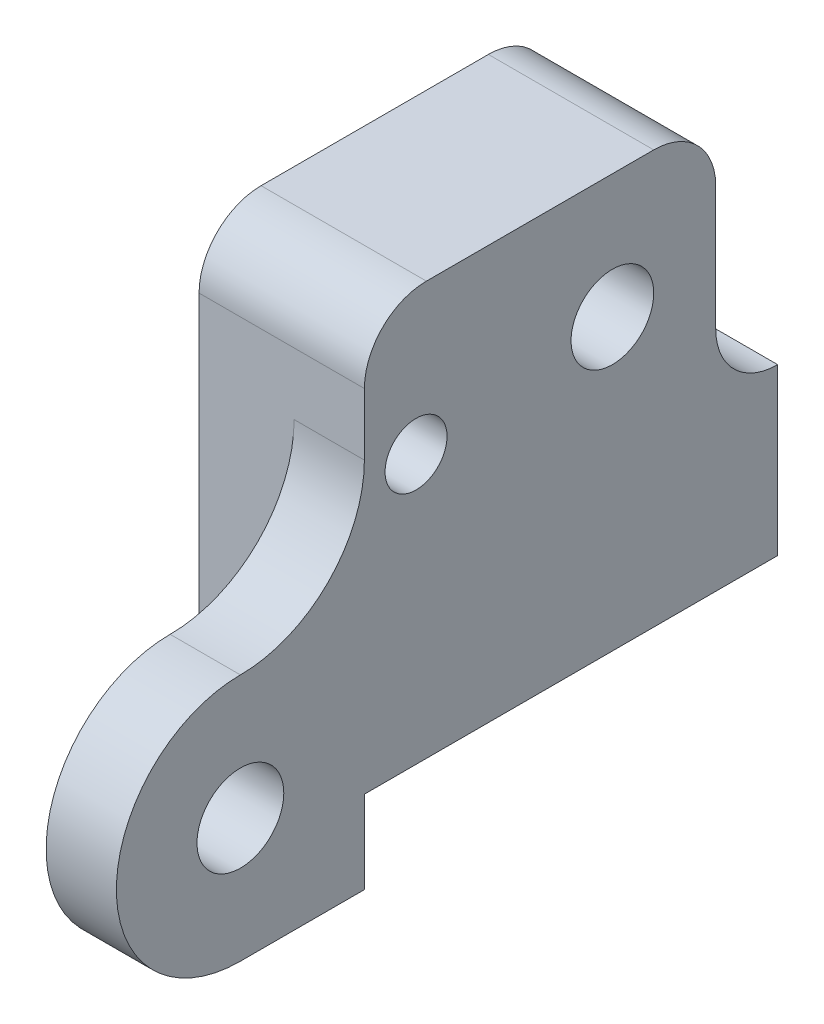
ISO-10303-21;
HEADER;
FILE_DESCRIPTION(('STEP AP214'),'2;1');
FILE_NAME('part.step','',(''),(''),'','','');
FILE_SCHEMA(('AUTOMOTIVE_DESIGN { 1 0 10303 214 1 1 1 1 }'));
ENDSEC;
DATA;
#1=APPLICATION_CONTEXT('core data for automotive mechanical design processes');
#2=APPLICATION_PROTOCOL_DEFINITION('international standard','automotive_design',2000,#1);
#3=PRODUCT_CONTEXT('',#1,'mechanical');
#4=PRODUCT('Part','Part','',(#3));
#5=PRODUCT_RELATED_PRODUCT_CATEGORY('part','',(#4));
#6=PRODUCT_DEFINITION_FORMATION('','',#4);
#7=PRODUCT_DEFINITION_CONTEXT('part definition',#1,'design');
#8=PRODUCT_DEFINITION('design','',#6,#7);
#9=PRODUCT_DEFINITION_SHAPE('','',#8);
#10=(LENGTH_UNIT() NAMED_UNIT(*) SI_UNIT(.MILLI.,.METRE.));
#11=(NAMED_UNIT(*) PLANE_ANGLE_UNIT() SI_UNIT($,.RADIAN.));
#12=(NAMED_UNIT(*) SI_UNIT($,.STERADIAN.) SOLID_ANGLE_UNIT());
#13=UNCERTAINTY_MEASURE_WITH_UNIT(LENGTH_MEASURE(1.E-05),#10,'distance_accuracy_value','');
#14=(GEOMETRIC_REPRESENTATION_CONTEXT(3) GLOBAL_UNCERTAINTY_ASSIGNED_CONTEXT((#13)) GLOBAL_UNIT_ASSIGNED_CONTEXT((#10,
#11,#12)) REPRESENTATION_CONTEXT('',''));
#15=CARTESIAN_POINT('',(0.,0.,0.));
#16=DIRECTION('',(0.,0.,1.));
#17=DIRECTION('',(1.,0.,0.));
#18=AXIS2_PLACEMENT_3D('',#15,#16,#17);
#19=CARTESIAN_POINT('',(8.,6.,0.));
#20=DIRECTION('',(-1.,0.,0.));
#21=DIRECTION('',(0.,0.,1.));
#22=AXIS2_PLACEMENT_3D('',#19,#20,#21);
#23=PLANE('',#22);
#24=CARTESIAN_POINT('',(8.,18.,-18.));
#25=DIRECTION('',(1.,0.,0.));
#26=DIRECTION('',(0.,0.,-1.));
#27=AXIS2_PLACEMENT_3D('',#24,#25,#26);
#28=CIRCLE('',#27,2.00000000000001);
#29=CARTESIAN_POINT('',(8.,18.,-20.));
#30=VERTEX_POINT('',#29);
#31=EDGE_CURVE('E303',#30,#30,#28,.T.);
#32=ORIENTED_EDGE('',*,*,#31,.F.);
#33=EDGE_LOOP('',(#32));
#34=FACE_BOUND('',#33,.T.);
#35=DIRECTION('',(0.,0.,1.));
#36=VECTOR('',#35,1.);
#37=CARTESIAN_POINT('',(8.,24.,-6.));
#38=LINE('',#37,#36);
#39=CARTESIAN_POINT('',(8.,24.,-20.));
#40=VERTEX_POINT('',#39);
#41=CARTESIAN_POINT('',(8.,24.,-9.));
#42=VERTEX_POINT('',#41);
#43=EDGE_CURVE('E209',#40,#42,#38,.T.);
#44=ORIENTED_EDGE('',*,*,#43,.T.);
#45=CARTESIAN_POINT('',(8.,21.,-9.));
#46=DIRECTION('',(-1.,0.,0.));
#47=DIRECTION('',(0.,0.,1.));
#48=AXIS2_PLACEMENT_3D('',#45,#46,#47);
#49=CIRCLE('',#48,3.);
#50=CARTESIAN_POINT('',(8.,21.,-6.));
#51=VERTEX_POINT('',#50);
#52=EDGE_CURVE('E181',#42,#51,#49,.F.);
#53=ORIENTED_EDGE('',*,*,#52,.T.);
#54=DIRECTION('',(0.,-1.,0.));
#55=VECTOR('',#54,1.);
#56=CARTESIAN_POINT('',(8.,12.,-6.));
#57=LINE('',#56,#55);
#58=CARTESIAN_POINT('',(8.,18.,-6.));
#59=VERTEX_POINT('',#58);
#60=EDGE_CURVE('E248',#51,#59,#57,.T.);
#61=ORIENTED_EDGE('',*,*,#60,.T.);
#62=CARTESIAN_POINT('',(8.,18.,0.));
#63=DIRECTION('',(-1.,0.,0.));
#64=DIRECTION('',(0.,0.,1.));
#65=AXIS2_PLACEMENT_3D('',#62,#63,#64);
#66=CIRCLE('',#65,6.);
#67=CARTESIAN_POINT('',(8.,12.,0.));
#68=VERTEX_POINT('',#67);
#69=EDGE_CURVE('E11',#59,#68,#66,.T.);
#70=ORIENTED_EDGE('',*,*,#69,.T.);
#71=CARTESIAN_POINT('',(8.,6.,0.));
#72=DIRECTION('',(1.,0.,0.));
#73=DIRECTION('',(0.,0.,1.));
#74=AXIS2_PLACEMENT_3D('',#71,#72,#73);
#75=CIRCLE('',#74,6.);
#76=CARTESIAN_POINT('',(8.,0.,0.));
#77=VERTEX_POINT('',#76);
#78=EDGE_CURVE('E250',#68,#77,#75,.T.);
#79=ORIENTED_EDGE('',*,*,#78,.T.);
#80=DIRECTION('',(0.,0.,-1.));
#81=VECTOR('',#80,1.);
#82=CARTESIAN_POINT('',(8.,0.,-6.));
#83=LINE('',#82,#81);
#84=CARTESIAN_POINT('',(8.,0.,-6.));
#85=VERTEX_POINT('',#84);
#86=EDGE_CURVE('E151',#77,#85,#83,.T.);
#87=ORIENTED_EDGE('',*,*,#86,.T.);
#88=DIRECTION('',(0.,1.,0.));
#89=VECTOR('',#88,1.);
#90=CARTESIAN_POINT('',(8.,4.,-6.));
#91=LINE('',#90,#89);
#92=CARTESIAN_POINT('',(8.,4.,-6.));
#93=VERTEX_POINT('',#92);
#94=EDGE_CURVE('E233',#85,#93,#91,.T.);
#95=ORIENTED_EDGE('',*,*,#94,.T.);
#96=DIRECTION('',(0.,0.,-1.));
#97=VECTOR('',#96,1.);
#98=CARTESIAN_POINT('',(8.,4.,-26.));
#99=LINE('',#98,#97);
#100=CARTESIAN_POINT('',(8.,4.,-26.));
#101=VERTEX_POINT('',#100);
#102=EDGE_CURVE('E237',#93,#101,#99,.T.);
#103=ORIENTED_EDGE('',*,*,#102,.T.);
#104=DIRECTION('',(0.,1.,0.));
#105=VECTOR('',#104,1.);
#106=CARTESIAN_POINT('',(8.,12.,-26.));
#107=LINE('',#106,#105);
#108=CARTESIAN_POINT('',(8.,12.,-26.));
#109=VERTEX_POINT('',#108);
#110=EDGE_CURVE('E200',#101,#109,#107,.T.);
#111=ORIENTED_EDGE('',*,*,#110,.T.);
#112=CARTESIAN_POINT('',(8.,15.,-26.));
#113=DIRECTION('',(-1.,0.,0.));
#114=DIRECTION('',(0.,0.,1.));
#115=AXIS2_PLACEMENT_3D('',#112,#113,#114);
#116=CIRCLE('',#115,3.);
#117=CARTESIAN_POINT('',(8.,15.,-23.));
#118=VERTEX_POINT('',#117);
#119=EDGE_CURVE('E190',#109,#118,#116,.T.);
#120=ORIENTED_EDGE('',*,*,#119,.T.);
#121=DIRECTION('',(0.,1.,0.));
#122=VECTOR('',#121,1.);
#123=CARTESIAN_POINT('',(8.,24.,-23.));
#124=LINE('',#123,#122);
#125=CARTESIAN_POINT('',(8.,21.,-23.));
#126=VERTEX_POINT('',#125);
#127=EDGE_CURVE('E197',#118,#126,#124,.T.);
#128=ORIENTED_EDGE('',*,*,#127,.T.);
#129=CARTESIAN_POINT('',(8.,21.,-20.));
#130=DIRECTION('',(-1.,0.,0.));
#131=DIRECTION('',(0.,0.,1.));
#132=AXIS2_PLACEMENT_3D('',#129,#130,#131);
#133=CIRCLE('',#132,3.);
#134=EDGE_CURVE('E179',#126,#40,#133,.F.);
#135=ORIENTED_EDGE('',*,*,#134,.T.);
#136=EDGE_LOOP('',(#44,#53,#61,#70,#79,#87,#95,#103,#111,#120,#128,#135));
#137=FACE_BOUND('',#136,.T.);
#138=CARTESIAN_POINT('',(8.,17.,-8.5));
#139=DIRECTION('',(1.,0.,0.));
#140=DIRECTION('',(0.,0.,-1.));
#141=AXIS2_PLACEMENT_3D('',#138,#139,#140);
#142=CIRCLE('',#141,1.5);
#143=CARTESIAN_POINT('',(8.,17.,-10.));
#144=VERTEX_POINT('',#143);
#145=EDGE_CURVE('E227',#144,#144,#142,.T.);
#146=ORIENTED_EDGE('',*,*,#145,.F.);
#147=EDGE_LOOP('',(#146));
#148=FACE_BOUND('',#147,.T.);
#149=CARTESIAN_POINT('',(8.,6.,0.));
#150=DIRECTION('',(1.,0.,0.));
#151=DIRECTION('',(0.,0.,-1.));
#152=AXIS2_PLACEMENT_3D('',#149,#150,#151);
#153=CIRCLE('',#152,2.09999999999999);
#154=CARTESIAN_POINT('',(8.,6.,-2.09999999999999));
#155=VERTEX_POINT('',#154);
#156=EDGE_CURVE('E308',#155,#155,#153,.T.);
#157=ORIENTED_EDGE('',*,*,#156,.F.);
#158=EDGE_LOOP('',(#157));
#159=FACE_BOUND('',#158,.T.);
#160=ADVANCED_FACE('F33',(#34,#137,#148,#159),#23,.F.);
#161=CARTESIAN_POINT('',(0.,6.,0.));
#162=DIRECTION('',(-1.,0.,0.));
#163=DIRECTION('',(0.,0.,1.));
#164=AXIS2_PLACEMENT_3D('',#161,#162,#163);
#165=PLANE('',#164);
#166=DIRECTION('',(0.,0.,-1.));
#167=VECTOR('',#166,1.);
#168=CARTESIAN_POINT('',(0.,4.,-26.));
#169=LINE('',#168,#167);
#170=CARTESIAN_POINT('',(0.,4.,-6.));
#171=VERTEX_POINT('',#170);
#172=CARTESIAN_POINT('',(0.,4.,-26.));
#173=VERTEX_POINT('',#172);
#174=EDGE_CURVE('E223',#171,#173,#169,.T.);
#175=ORIENTED_EDGE('',*,*,#174,.F.);
#176=DIRECTION('',(0.,-1.,0.));
#177=VECTOR('',#176,1.);
#178=CARTESIAN_POINT('',(0.,12.,-6.));
#179=LINE('',#178,#177);
#180=CARTESIAN_POINT('',(0.,21.,-6.));
#181=VERTEX_POINT('',#180);
#182=EDGE_CURVE('E232',#181,#171,#179,.T.);
#183=ORIENTED_EDGE('',*,*,#182,.F.);
#184=CARTESIAN_POINT('',(0.,21.,-9.));
#185=DIRECTION('',(-1.,0.,0.));
#186=DIRECTION('',(0.,0.,1.));
#187=AXIS2_PLACEMENT_3D('',#184,#185,#186);
#188=CIRCLE('',#187,3.);
#189=CARTESIAN_POINT('',(0.,24.,-9.));
#190=VERTEX_POINT('',#189);
#191=EDGE_CURVE('E172',#181,#190,#188,.T.);
#192=ORIENTED_EDGE('',*,*,#191,.T.);
#193=DIRECTION('',(0.,0.,1.));
#194=VECTOR('',#193,1.);
#195=CARTESIAN_POINT('',(0.,24.,-6.));
#196=LINE('',#195,#194);
#197=CARTESIAN_POINT('',(0.,24.,-20.));
#198=VERTEX_POINT('',#197);
#199=EDGE_CURVE('E225',#198,#190,#196,.T.);
#200=ORIENTED_EDGE('',*,*,#199,.F.);
#201=CARTESIAN_POINT('',(0.,21.,-20.));
#202=DIRECTION('',(-1.,0.,0.));
#203=DIRECTION('',(0.,0.,1.));
#204=AXIS2_PLACEMENT_3D('',#201,#202,#203);
#205=CIRCLE('',#204,3.);
#206=CARTESIAN_POINT('',(0.,21.,-23.));
#207=VERTEX_POINT('',#206);
#208=EDGE_CURVE('E170',#198,#207,#205,.T.);
#209=ORIENTED_EDGE('',*,*,#208,.T.);
#210=DIRECTION('',(0.,1.,0.));
#211=VECTOR('',#210,1.);
#212=CARTESIAN_POINT('',(0.,24.,-23.));
#213=LINE('',#212,#211);
#214=CARTESIAN_POINT('',(0.,15.,-23.));
#215=VERTEX_POINT('',#214);
#216=EDGE_CURVE('E219',#215,#207,#213,.T.);
#217=ORIENTED_EDGE('',*,*,#216,.F.);
#218=CARTESIAN_POINT('',(0.,15.,-26.));
#219=DIRECTION('',(-1.,0.,0.));
#220=DIRECTION('',(0.,0.,1.));
#221=AXIS2_PLACEMENT_3D('',#218,#219,#220);
#222=CIRCLE('',#221,3.);
#223=CARTESIAN_POINT('',(0.,12.,-26.));
#224=VERTEX_POINT('',#223);
#225=EDGE_CURVE('E188',#215,#224,#222,.F.);
#226=ORIENTED_EDGE('',*,*,#225,.T.);
#227=DIRECTION('',(0.,1.,0.));
#228=VECTOR('',#227,1.);
#229=CARTESIAN_POINT('',(0.,12.,-26.));
#230=LINE('',#229,#228);
#231=EDGE_CURVE('E218',#173,#224,#230,.T.);
#232=ORIENTED_EDGE('',*,*,#231,.F.);
#233=EDGE_LOOP('',(#175,#183,#192,#200,#209,#217,#226,#232));
#234=FACE_BOUND('',#233,.T.);
#235=CARTESIAN_POINT('',(0.,17.,-8.5));
#236=DIRECTION('',(1.,0.,0.));
#237=DIRECTION('',(0.,0.,-1.));
#238=AXIS2_PLACEMENT_3D('',#235,#236,#237);
#239=CIRCLE('',#238,1.5);
#240=CARTESIAN_POINT('',(0.,17.,-10.));
#241=VERTEX_POINT('',#240);
#242=EDGE_CURVE('E243',#241,#241,#239,.T.);
#243=ORIENTED_EDGE('',*,*,#242,.T.);
#244=EDGE_LOOP('',(#243));
#245=FACE_BOUND('',#244,.T.);
#246=CARTESIAN_POINT('',(0.,18.,-18.));
#247=DIRECTION('',(1.,0.,0.));
#248=DIRECTION('',(0.,0.,-1.));
#249=AXIS2_PLACEMENT_3D('',#246,#247,#248);
#250=CIRCLE('',#249,2.00000000000001);
#251=CARTESIAN_POINT('',(0.,18.,-20.));
#252=VERTEX_POINT('',#251);
#253=EDGE_CURVE('E305',#252,#252,#250,.T.);
#254=ORIENTED_EDGE('',*,*,#253,.T.);
#255=EDGE_LOOP('',(#254));
#256=FACE_BOUND('',#255,.T.);
#257=ADVANCED_FACE('F216',(#234,#245,#256),#165,.T.);
#258=CARTESIAN_POINT('',(8.,4.,-6.));
#259=DIRECTION('',(0.,0.,1.));
#260=DIRECTION('',(0.,-1.,0.));
#261=AXIS2_PLACEMENT_3D('',#258,#259,#260);
#262=PLANE('',#261);
#263=DIRECTION('',(-1.,0.,0.));
#264=VECTOR('',#263,1.);
#265=CARTESIAN_POINT('',(8.,0.,-6.));
#266=LINE('',#265,#264);
#267=CARTESIAN_POINT('',(4.6,0.,-6.));
#268=VERTEX_POINT('',#267);
#269=EDGE_CURVE('E152',#85,#268,#266,.T.);
#270=ORIENTED_EDGE('',*,*,#269,.T.);
#271=DIRECTION('',(0.,-1.,0.));
#272=VECTOR('',#271,1.);
#273=CARTESIAN_POINT('',(4.6,24.001,-6.));
#274=LINE('',#273,#272);
#275=CARTESIAN_POINT('',(4.6,4.,-6.));
#276=VERTEX_POINT('',#275);
#277=EDGE_CURVE('E134',#276,#268,#274,.T.);
#278=ORIENTED_EDGE('',*,*,#277,.F.);
#279=DIRECTION('',(-1.,0.,0.));
#280=VECTOR('',#279,1.);
#281=CARTESIAN_POINT('',(8.,4.,-6.));
#282=LINE('',#281,#280);
#283=EDGE_CURVE('E164',#93,#276,#282,.T.);
#284=ORIENTED_EDGE('',*,*,#283,.F.);
#285=ORIENTED_EDGE('',*,*,#94,.F.);
#286=EDGE_LOOP('',(#270,#278,#284,#285));
#287=FACE_BOUND('',#286,.T.);
#288=ADVANCED_FACE('F252',(#287),#262,.F.);
#289=CARTESIAN_POINT('',(8.,4.,-26.));
#290=DIRECTION('',(0.,1.,0.));
#291=DIRECTION('',(0.,0.,1.));
#292=AXIS2_PLACEMENT_3D('',#289,#290,#291);
#293=PLANE('',#292);
#294=CARTESIAN_POINT('',(4.,4.,-10.));
#295=DIRECTION('',(0.,-1.,0.));
#296=DIRECTION('',(0.,0.,-1.));
#297=AXIS2_PLACEMENT_3D('',#294,#295,#296);
#298=CIRCLE('',#297,1.25);
#299=CARTESIAN_POINT('',(4.,4.,-11.25));
#300=VERTEX_POINT('',#299);
#301=EDGE_CURVE('E322',#300,#300,#298,.T.);
#302=ORIENTED_EDGE('',*,*,#301,.F.);
#303=EDGE_LOOP('',(#302));
#304=FACE_BOUND('',#303,.T.);
#305=CARTESIAN_POINT('',(4.,4.,-22.));
#306=DIRECTION('',(0.,-1.,0.));
#307=DIRECTION('',(0.,0.,-1.));
#308=AXIS2_PLACEMENT_3D('',#305,#306,#307);
#309=CIRCLE('',#308,1.25);
#310=CARTESIAN_POINT('',(4.,4.,-23.25));
#311=VERTEX_POINT('',#310);
#312=EDGE_CURVE('E316',#311,#311,#309,.T.);
#313=ORIENTED_EDGE('',*,*,#312,.F.);
#314=EDGE_LOOP('',(#313));
#315=FACE_BOUND('',#314,.T.);
#316=ORIENTED_EDGE('',*,*,#174,.T.);
#317=DIRECTION('',(-1.,0.,0.));
#318=VECTOR('',#317,1.);
#319=CARTESIAN_POINT('',(8.,4.,-26.));
#320=LINE('',#319,#318);
#321=EDGE_CURVE('E161',#101,#173,#320,.T.);
#322=ORIENTED_EDGE('',*,*,#321,.F.);
#323=ORIENTED_EDGE('',*,*,#102,.F.);
#324=ORIENTED_EDGE('',*,*,#283,.T.);
#325=DIRECTION('',(-1.,0.,0.));
#326=VECTOR('',#325,1.);
#327=CARTESIAN_POINT('',(8.,4.,-6.));
#328=LINE('',#327,#326);
#329=EDGE_CURVE('E255',#276,#171,#328,.T.);
#330=ORIENTED_EDGE('',*,*,#329,.T.);
#331=EDGE_LOOP('',(#316,#322,#323,#324,#330));
#332=FACE_BOUND('',#331,.T.);
#333=ADVANCED_FACE('F254',(#304,#315,#332),#293,.F.);
#334=CARTESIAN_POINT('',(8.,12.,-26.));
#335=DIRECTION('',(0.,0.,1.));
#336=DIRECTION('',(1.,0.,0.));
#337=AXIS2_PLACEMENT_3D('',#334,#335,#336);
#338=PLANE('',#337);
#339=ORIENTED_EDGE('',*,*,#231,.T.);
#340=DIRECTION('',(-1.,0.,0.));
#341=VECTOR('',#340,1.);
#342=CARTESIAN_POINT('',(8.,12.,-26.));
#343=LINE('',#342,#341);
#344=EDGE_CURVE('E154',#109,#224,#343,.T.);
#345=ORIENTED_EDGE('',*,*,#344,.F.);
#346=ORIENTED_EDGE('',*,*,#110,.F.);
#347=ORIENTED_EDGE('',*,*,#321,.T.);
#348=EDGE_LOOP('',(#339,#345,#346,#347));
#349=FACE_BOUND('',#348,.T.);
#350=ADVANCED_FACE('F221',(#349),#338,.F.);
#351=CARTESIAN_POINT('',(8.,24.,-23.));
#352=DIRECTION('',(0.,0.,1.));
#353=DIRECTION('',(1.,0.,0.));
#354=AXIS2_PLACEMENT_3D('',#351,#352,#353);
#355=PLANE('',#354);
#356=ORIENTED_EDGE('',*,*,#216,.T.);
#357=DIRECTION('',(-1.,0.,0.));
#358=VECTOR('',#357,1.);
#359=CARTESIAN_POINT('',(8.,21.,-23.));
#360=LINE('',#359,#358);
#361=EDGE_CURVE('E186',#207,#126,#360,.F.);
#362=ORIENTED_EDGE('',*,*,#361,.T.);
#363=ORIENTED_EDGE('',*,*,#127,.F.);
#364=DIRECTION('',(-1.,0.,0.));
#365=VECTOR('',#364,1.);
#366=CARTESIAN_POINT('',(0.,15.,-23.));
#367=LINE('',#366,#365);
#368=EDGE_CURVE('E183',#118,#215,#367,.T.);
#369=ORIENTED_EDGE('',*,*,#368,.T.);
#370=EDGE_LOOP('',(#356,#362,#363,#369));
#371=FACE_BOUND('',#370,.T.);
#372=ADVANCED_FACE('F206',(#371),#355,.F.);
#373=CARTESIAN_POINT('',(8.,24.,-6.));
#374=DIRECTION('',(0.,-1.,0.));
#375=DIRECTION('',(0.,0.,-1.));
#376=AXIS2_PLACEMENT_3D('',#373,#374,#375);
#377=PLANE('',#376);
#378=ORIENTED_EDGE('',*,*,#199,.T.);
#379=DIRECTION('',(-1.,0.,0.));
#380=VECTOR('',#379,1.);
#381=CARTESIAN_POINT('',(8.,24.,-9.));
#382=LINE('',#381,#380);
#383=EDGE_CURVE('E177',#190,#42,#382,.F.);
#384=ORIENTED_EDGE('',*,*,#383,.T.);
#385=ORIENTED_EDGE('',*,*,#43,.F.);
#386=DIRECTION('',(-1.,0.,0.));
#387=VECTOR('',#386,1.);
#388=CARTESIAN_POINT('',(8.,24.,-20.));
#389=LINE('',#388,#387);
#390=EDGE_CURVE('E174',#40,#198,#389,.T.);
#391=ORIENTED_EDGE('',*,*,#390,.T.);
#392=EDGE_LOOP('',(#378,#384,#385,#391));
#393=FACE_BOUND('',#392,.T.);
#394=ADVANCED_FACE('F261',(#393),#377,.F.);
#395=CARTESIAN_POINT('',(8.,12.,-6.));
#396=DIRECTION('',(0.,0.,-1.));
#397=DIRECTION('',(-1.,0.,0.));
#398=AXIS2_PLACEMENT_3D('',#395,#396,#397);
#399=PLANE('',#398);
#400=ORIENTED_EDGE('',*,*,#182,.T.);
#401=ORIENTED_EDGE('',*,*,#329,.F.);
#402=CARTESIAN_POINT('',(4.6,18.,-6.));
#403=VERTEX_POINT('',#402);
#404=EDGE_CURVE('E329',#403,#276,#274,.T.);
#405=ORIENTED_EDGE('',*,*,#404,.F.);
#406=DIRECTION('',(-1.,0.,0.));
#407=VECTOR('',#406,1.);
#408=CARTESIAN_POINT('',(8.,18.,-6.));
#409=LINE('',#408,#407);
#410=EDGE_CURVE('E41',#403,#59,#409,.F.);
#411=ORIENTED_EDGE('',*,*,#410,.T.);
#412=ORIENTED_EDGE('',*,*,#60,.F.);
#413=DIRECTION('',(-1.,0.,0.));
#414=VECTOR('',#413,1.);
#415=CARTESIAN_POINT('',(8.,21.,-6.));
#416=LINE('',#415,#414);
#417=EDGE_CURVE('E167',#51,#181,#416,.T.);
#418=ORIENTED_EDGE('',*,*,#417,.T.);
#419=EDGE_LOOP('',(#400,#401,#405,#411,#412,#418));
#420=FACE_BOUND('',#419,.T.);
#421=ADVANCED_FACE('F267',(#420),#399,.F.);
#422=CARTESIAN_POINT('',(8.,6.,0.));
#423=DIRECTION('',(-1.,0.,0.));
#424=DIRECTION('',(0.,0.,1.));
#425=AXIS2_PLACEMENT_3D('',#422,#423,#424);
#426=CYLINDRICAL_SURFACE('',#425,6.);
#427=DIRECTION('',(-1.,0.,0.));
#428=VECTOR('',#427,1.);
#429=CARTESIAN_POINT('',(8.,12.,0.));
#430=LINE('',#429,#428);
#431=CARTESIAN_POINT('',(4.6,12.,0.));
#432=VERTEX_POINT('',#431);
#433=EDGE_CURVE('E148',#68,#432,#430,.T.);
#434=ORIENTED_EDGE('',*,*,#433,.T.);
#435=CARTESIAN_POINT('',(4.6,6.,0.));
#436=DIRECTION('',(1.,0.,0.));
#437=DIRECTION('',(0.,0.,-1.));
#438=AXIS2_PLACEMENT_3D('',#435,#436,#437);
#439=CIRCLE('',#438,6.);
#440=CARTESIAN_POINT('',(4.6,0.,0.));
#441=VERTEX_POINT('',#440);
#442=EDGE_CURVE('E132',#441,#432,#439,.F.);
#443=ORIENTED_EDGE('',*,*,#442,.F.);
#444=DIRECTION('',(-1.,0.,0.));
#445=VECTOR('',#444,1.);
#446=CARTESIAN_POINT('',(8.,0.,0.));
#447=LINE('',#446,#445);
#448=EDGE_CURVE('E145',#77,#441,#447,.T.);
#449=ORIENTED_EDGE('',*,*,#448,.F.);
#450=ORIENTED_EDGE('',*,*,#78,.F.);
#451=EDGE_LOOP('',(#434,#443,#449,#450));
#452=FACE_BOUND('',#451,.T.);
#453=ADVANCED_FACE('F143',(#452),#426,.T.);
#454=CARTESIAN_POINT('',(8.,0.,-6.));
#455=DIRECTION('',(0.,1.,0.));
#456=DIRECTION('',(0.,0.,1.));
#457=AXIS2_PLACEMENT_3D('',#454,#455,#456);
#458=PLANE('',#457);
#459=ORIENTED_EDGE('',*,*,#448,.T.);
#460=DIRECTION('',(0.,0.,1.));
#461=VECTOR('',#460,1.);
#462=CARTESIAN_POINT('',(4.6,0.,6.));
#463=LINE('',#462,#461);
#464=EDGE_CURVE('E129',#268,#441,#463,.T.);
#465=ORIENTED_EDGE('',*,*,#464,.F.);
#466=ORIENTED_EDGE('',*,*,#269,.F.);
#467=ORIENTED_EDGE('',*,*,#86,.F.);
#468=EDGE_LOOP('',(#459,#465,#466,#467));
#469=FACE_BOUND('',#468,.T.);
#470=ADVANCED_FACE('F150',(#469),#458,.F.);
#471=CARTESIAN_POINT('',(8.,17.,-8.5));
#472=DIRECTION('',(-1.,0.,0.));
#473=DIRECTION('',(0.,0.,1.));
#474=AXIS2_PLACEMENT_3D('',#471,#472,#473);
#475=CYLINDRICAL_SURFACE('',#474,1.5);
#476=ORIENTED_EDGE('',*,*,#145,.T.);
#477=EDGE_LOOP('',(#476));
#478=FACE_BOUND('',#477,.T.);
#479=ORIENTED_EDGE('',*,*,#242,.F.);
#480=EDGE_LOOP('',(#479));
#481=FACE_BOUND('',#480,.T.);
#482=ADVANCED_FACE('F285',(#478,#481),#475,.F.);
#483=CARTESIAN_POINT('',(8.,18.,-18.));
#484=DIRECTION('',(-1.,0.,0.));
#485=DIRECTION('',(0.,0.,1.));
#486=AXIS2_PLACEMENT_3D('',#483,#484,#485);
#487=CYLINDRICAL_SURFACE('',#486,2.00000000000001);
#488=ORIENTED_EDGE('',*,*,#31,.T.);
#489=EDGE_LOOP('',(#488));
#490=FACE_BOUND('',#489,.T.);
#491=ORIENTED_EDGE('',*,*,#253,.F.);
#492=EDGE_LOOP('',(#491));
#493=FACE_BOUND('',#492,.T.);
#494=ADVANCED_FACE('F292',(#490,#493),#487,.F.);
#495=CARTESIAN_POINT('',(8.,21.,-9.));
#496=DIRECTION('',(-1.,0.,0.));
#497=DIRECTION('',(0.,0.,1.));
#498=AXIS2_PLACEMENT_3D('',#495,#496,#497);
#499=CYLINDRICAL_SURFACE('',#498,3.);
#500=ORIENTED_EDGE('',*,*,#52,.F.);
#501=ORIENTED_EDGE('',*,*,#383,.F.);
#502=ORIENTED_EDGE('',*,*,#191,.F.);
#503=ORIENTED_EDGE('',*,*,#417,.F.);
#504=EDGE_LOOP('',(#500,#501,#502,#503));
#505=FACE_BOUND('',#504,.T.);
#506=ADVANCED_FACE('F265',(#505),#499,.T.);
#507=CARTESIAN_POINT('',(8.,21.,-20.));
#508=DIRECTION('',(-1.,0.,0.));
#509=DIRECTION('',(0.,0.,1.));
#510=AXIS2_PLACEMENT_3D('',#507,#508,#509);
#511=CYLINDRICAL_SURFACE('',#510,3.);
#512=ORIENTED_EDGE('',*,*,#134,.F.);
#513=ORIENTED_EDGE('',*,*,#361,.F.);
#514=ORIENTED_EDGE('',*,*,#208,.F.);
#515=ORIENTED_EDGE('',*,*,#390,.F.);
#516=EDGE_LOOP('',(#512,#513,#514,#515));
#517=FACE_BOUND('',#516,.T.);
#518=ADVANCED_FACE('F341',(#517),#511,.T.);
#519=CARTESIAN_POINT('',(8.,15.,-26.));
#520=DIRECTION('',(1.,0.,0.));
#521=DIRECTION('',(0.,0.,-1.));
#522=AXIS2_PLACEMENT_3D('',#519,#520,#521);
#523=CYLINDRICAL_SURFACE('',#522,3.);
#524=ORIENTED_EDGE('',*,*,#119,.F.);
#525=ORIENTED_EDGE('',*,*,#344,.T.);
#526=ORIENTED_EDGE('',*,*,#225,.F.);
#527=ORIENTED_EDGE('',*,*,#368,.F.);
#528=EDGE_LOOP('',(#524,#525,#526,#527));
#529=FACE_BOUND('',#528,.T.);
#530=ADVANCED_FACE('F211',(#529),#523,.F.);
#531=CARTESIAN_POINT('',(8.,18.,0.));
#532=DIRECTION('',(1.,0.,0.));
#533=DIRECTION('',(0.,0.,-1.));
#534=AXIS2_PLACEMENT_3D('',#531,#532,#533);
#535=CYLINDRICAL_SURFACE('',#534,6.);
#536=ORIENTED_EDGE('',*,*,#410,.F.);
#537=CARTESIAN_POINT('',(4.6,18.,0.));
#538=DIRECTION('',(1.,0.,0.));
#539=DIRECTION('',(0.,0.,-1.));
#540=AXIS2_PLACEMENT_3D('',#537,#538,#539);
#541=CIRCLE('',#540,6.);
#542=EDGE_CURVE('E48',#432,#403,#541,.T.);
#543=ORIENTED_EDGE('',*,*,#542,.F.);
#544=ORIENTED_EDGE('',*,*,#433,.F.);
#545=ORIENTED_EDGE('',*,*,#69,.F.);
#546=EDGE_LOOP('',(#536,#543,#544,#545));
#547=FACE_BOUND('',#546,.T.);
#548=ADVANCED_FACE('F35',(#547),#535,.F.);
#549=CARTESIAN_POINT('',(8.,6.,0.));
#550=DIRECTION('',(1.,0.,0.));
#551=DIRECTION('',(0.,0.,-1.));
#552=AXIS2_PLACEMENT_3D('',#549,#550,#551);
#553=CYLINDRICAL_SURFACE('',#552,2.09999999999999);
#554=CARTESIAN_POINT('',(4.6,6.,0.));
#555=DIRECTION('',(1.,0.,0.));
#556=DIRECTION('',(0.,0.,-1.));
#557=AXIS2_PLACEMENT_3D('',#554,#555,#556);
#558=CIRCLE('',#557,2.09999999999999);
#559=CARTESIAN_POINT('',(4.6,6.,-2.09999999999999));
#560=VERTEX_POINT('',#559);
#561=EDGE_CURVE('E326',#560,#560,#558,.T.);
#562=ORIENTED_EDGE('',*,*,#561,.F.);
#563=EDGE_LOOP('',(#562));
#564=FACE_BOUND('',#563,.T.);
#565=ORIENTED_EDGE('',*,*,#156,.T.);
#566=EDGE_LOOP('',(#565));
#567=FACE_BOUND('',#566,.T.);
#568=ADVANCED_FACE('F333',(#564,#567),#553,.F.);
#569=CARTESIAN_POINT('',(4.,10.,-22.));
#570=DIRECTION('',(0.,-1.,0.));
#571=DIRECTION('',(0.,0.,-1.));
#572=AXIS2_PLACEMENT_3D('',#569,#570,#571);
#573=CONICAL_SURFACE('',#572,1.25,1.02974425867665);
#574=CARTESIAN_POINT('',(4.,10.7510757737845,-22.));
#575=VERTEX_POINT('',#574);
#576=VERTEX_LOOP('',#575);
#577=FACE_BOUND('',#576,.T.);
#578=CARTESIAN_POINT('',(4.,10.,-22.));
#579=DIRECTION('',(0.,-1.,0.));
#580=DIRECTION('',(0.,0.,-1.));
#581=AXIS2_PLACEMENT_3D('',#578,#579,#580);
#582=CIRCLE('',#581,1.25);
#583=CARTESIAN_POINT('',(4.,10.,-23.25));
#584=VERTEX_POINT('',#583);
#585=EDGE_CURVE('E313',#584,#584,#582,.T.);
#586=ORIENTED_EDGE('',*,*,#585,.T.);
#587=EDGE_LOOP('',(#586));
#588=FACE_BOUND('',#587,.T.);
#589=ADVANCED_FACE('F338',(#577,#588),#573,.F.);
#590=CARTESIAN_POINT('',(4.,4.,-22.));
#591=DIRECTION('',(0.,-1.,0.));
#592=DIRECTION('',(0.,0.,-1.));
#593=AXIS2_PLACEMENT_3D('',#590,#591,#592);
#594=CYLINDRICAL_SURFACE('',#593,1.25);
#595=ORIENTED_EDGE('',*,*,#585,.F.);
#596=EDGE_LOOP('',(#595));
#597=FACE_BOUND('',#596,.T.);
#598=ORIENTED_EDGE('',*,*,#312,.T.);
#599=EDGE_LOOP('',(#598));
#600=FACE_BOUND('',#599,.T.);
#601=ADVANCED_FACE('F399',(#597,#600),#594,.F.);
#602=CARTESIAN_POINT('',(4.,10.,-10.));
#603=DIRECTION('',(0.,-1.,0.));
#604=DIRECTION('',(0.,0.,-1.));
#605=AXIS2_PLACEMENT_3D('',#602,#603,#604);
#606=CONICAL_SURFACE('',#605,1.25,1.02974425867665);
#607=CARTESIAN_POINT('',(4.,10.7510757737845,-10.));
#608=VERTEX_POINT('',#607);
#609=VERTEX_LOOP('',#608);
#610=FACE_BOUND('',#609,.T.);
#611=CARTESIAN_POINT('',(4.,10.,-10.));
#612=DIRECTION('',(0.,-1.,0.));
#613=DIRECTION('',(0.,0.,-1.));
#614=AXIS2_PLACEMENT_3D('',#611,#612,#613);
#615=CIRCLE('',#614,1.25);
#616=CARTESIAN_POINT('',(4.,10.,-11.25));
#617=VERTEX_POINT('',#616);
#618=EDGE_CURVE('E319',#617,#617,#615,.T.);
#619=ORIENTED_EDGE('',*,*,#618,.T.);
#620=EDGE_LOOP('',(#619));
#621=FACE_BOUND('',#620,.T.);
#622=ADVANCED_FACE('F409',(#610,#621),#606,.F.);
#623=CARTESIAN_POINT('',(4.,4.,-10.));
#624=DIRECTION('',(0.,-1.,0.));
#625=DIRECTION('',(0.,0.,-1.));
#626=AXIS2_PLACEMENT_3D('',#623,#624,#625);
#627=CYLINDRICAL_SURFACE('',#626,1.25);
#628=ORIENTED_EDGE('',*,*,#618,.F.);
#629=EDGE_LOOP('',(#628));
#630=FACE_BOUND('',#629,.T.);
#631=ORIENTED_EDGE('',*,*,#301,.T.);
#632=EDGE_LOOP('',(#631));
#633=FACE_BOUND('',#632,.T.);
#634=ADVANCED_FACE('F419',(#630,#633),#627,.F.);
#635=CARTESIAN_POINT('',(4.6,24.001,6.));
#636=DIRECTION('',(1.,0.,0.));
#637=DIRECTION('',(0.,0.,-1.));
#638=AXIS2_PLACEMENT_3D('',#635,#636,#637);
#639=PLANE('',#638);
#640=ORIENTED_EDGE('',*,*,#561,.T.);
#641=EDGE_LOOP('',(#640));
#642=FACE_BOUND('',#641,.T.);
#643=ORIENTED_EDGE('',*,*,#442,.T.);
#644=ORIENTED_EDGE('',*,*,#542,.T.);
#645=ORIENTED_EDGE('',*,*,#404,.T.);
#646=ORIENTED_EDGE('',*,*,#277,.T.);
#647=ORIENTED_EDGE('',*,*,#464,.T.);
#648=EDGE_LOOP('',(#643,#644,#645,#646,#647));
#649=FACE_BOUND('',#648,.T.);
#650=ADVANCED_FACE('F131',(#642,#649),#639,.F.);
#651=CLOSED_SHELL('',(#160,#257,#288,#333,#350,#372,#394,#421,#453,#470,#482,#494,#506,#518,
#530,#548,#568,#589,#601,#622,#634,#650));
#652=MANIFOLD_SOLID_BREP('B2',#651);
#653=ADVANCED_BREP_SHAPE_REPRESENTATION('',(#18,#652),#14);
#654=SHAPE_DEFINITION_REPRESENTATION(#9,#653);
ENDSEC;
END-ISO-10303-21;
